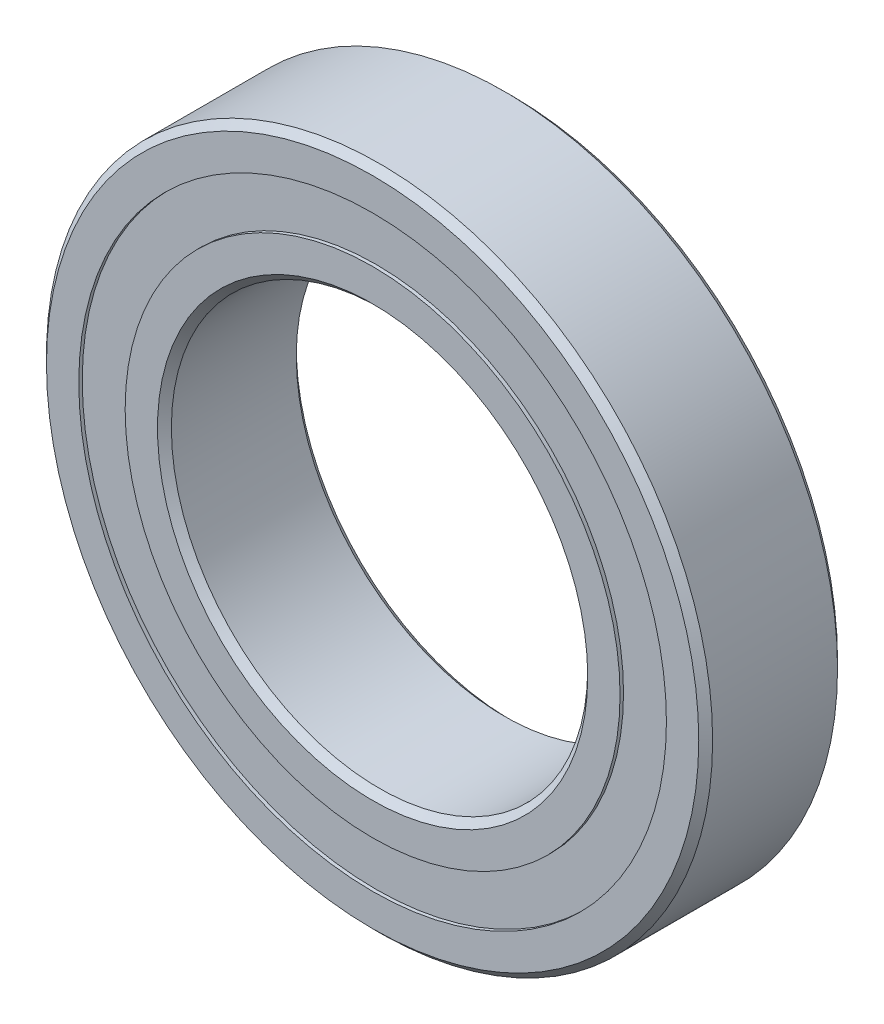
ISO-10303-21;
HEADER;
FILE_DESCRIPTION(('STEP AP214'),'2;1');
FILE_NAME('part.step','',(''),(''),'','','');
FILE_SCHEMA(('AUTOMOTIVE_DESIGN { 1 0 10303 214 1 1 1 1 }'));
ENDSEC;
DATA;
#1=APPLICATION_CONTEXT('core data for automotive mechanical design processes');
#2=APPLICATION_PROTOCOL_DEFINITION('international standard','automotive_design',2000,#1);
#3=PRODUCT_CONTEXT('',#1,'mechanical');
#4=PRODUCT('Part','Part','',(#3));
#5=PRODUCT_RELATED_PRODUCT_CATEGORY('part','',(#4));
#6=PRODUCT_DEFINITION_FORMATION('','',#4);
#7=PRODUCT_DEFINITION_CONTEXT('part definition',#1,'design');
#8=PRODUCT_DEFINITION('design','',#6,#7);
#9=PRODUCT_DEFINITION_SHAPE('','',#8);
#10=(LENGTH_UNIT() NAMED_UNIT(*) SI_UNIT(.MILLI.,.METRE.));
#11=(NAMED_UNIT(*) PLANE_ANGLE_UNIT() SI_UNIT($,.RADIAN.));
#12=(NAMED_UNIT(*) SI_UNIT($,.STERADIAN.) SOLID_ANGLE_UNIT());
#13=UNCERTAINTY_MEASURE_WITH_UNIT(LENGTH_MEASURE(1.E-05),#10,'distance_accuracy_value','');
#14=(GEOMETRIC_REPRESENTATION_CONTEXT(3) GLOBAL_UNCERTAINTY_ASSIGNED_CONTEXT((#13)) GLOBAL_UNIT_ASSIGNED_CONTEXT((#10,
#11,#12)) REPRESENTATION_CONTEXT('',''));
#15=CARTESIAN_POINT('',(0.,0.,0.));
#16=DIRECTION('',(0.,0.,1.));
#17=DIRECTION('',(1.,0.,0.));
#18=AXIS2_PLACEMENT_3D('',#15,#16,#17);
#19=CARTESIAN_POINT('',(0.,10.5851648351648,-2.37500000000001));
#20=DIRECTION('',(0.,0.,1.));
#21=DIRECTION('',(1.,0.,0.));
#22=AXIS2_PLACEMENT_3D('',#19,#20,#21);
#23=PLANE('',#22);
#24=CARTESIAN_POINT('',(0.,0.,-2.37500000000001));
#25=DIRECTION('',(0.,0.,1.));
#26=DIRECTION('',(1.,0.,0.));
#27=AXIS2_PLACEMENT_3D('',#24,#25,#26);
#28=CIRCLE('',#27,10.5851648351648);
#29=CARTESIAN_POINT('',(10.5851648351648,0.,-2.37500000000001));
#30=VERTEX_POINT('',#29);
#31=EDGE_CURVE('E57',#30,#30,#28,.T.);
#32=ORIENTED_EDGE('',*,*,#31,.F.);
#33=EDGE_LOOP('',(#32));
#34=FACE_BOUND('',#33,.T.);
#35=CARTESIAN_POINT('',(0.,0.,-2.37500000000001));
#36=DIRECTION('',(0.,0.,1.));
#37=DIRECTION('',(1.,0.,0.));
#38=AXIS2_PLACEMENT_3D('',#35,#36,#37);
#39=CIRCLE('',#38,8.91483516483517);
#40=CARTESIAN_POINT('',(8.91483516483517,0.,-2.37500000000001));
#41=VERTEX_POINT('',#40);
#42=EDGE_CURVE('E11',#41,#41,#39,.T.);
#43=ORIENTED_EDGE('',*,*,#42,.T.);
#44=EDGE_LOOP('',(#43));
#45=FACE_BOUND('',#44,.T.);
#46=ADVANCED_FACE('F43',(#34,#45),#23,.F.);
#47=CARTESIAN_POINT('',(0.,0.,2.5));
#48=DIRECTION('',(0.,0.,1.));
#49=DIRECTION('',(1.,0.,0.));
#50=AXIS2_PLACEMENT_3D('',#47,#48,#49);
#51=CYLINDRICAL_SURFACE('',#50,8.91483516483517);
#52=ORIENTED_EDGE('',*,*,#42,.F.);
#53=EDGE_LOOP('',(#52));
#54=FACE_BOUND('',#53,.T.);
#55=CARTESIAN_POINT('',(0.,0.,-1.38998856223009));
#56=DIRECTION('',(0.,0.,1.));
#57=DIRECTION('',(1.,0.,0.));
#58=AXIS2_PLACEMENT_3D('',#55,#56,#57);
#59=CIRCLE('',#58,8.91483516483517);
#60=CARTESIAN_POINT('',(8.91483516483517,0.,-1.38998856223009));
#61=VERTEX_POINT('',#60);
#62=EDGE_CURVE('E49',#61,#61,#59,.T.);
#63=ORIENTED_EDGE('',*,*,#62,.T.);
#64=EDGE_LOOP('',(#63));
#65=FACE_BOUND('',#64,.T.);
#66=ADVANCED_FACE('F66',(#54,#65),#51,.F.);
#67=CARTESIAN_POINT('',(0.,10.5851648351648,-1.38998856223009));
#68=DIRECTION('',(0.,0.,-1.));
#69=DIRECTION('',(-1.,0.,0.));
#70=AXIS2_PLACEMENT_3D('',#67,#68,#69);
#71=PLANE('',#70);
#72=ORIENTED_EDGE('',*,*,#62,.F.);
#73=EDGE_LOOP('',(#72));
#74=FACE_BOUND('',#73,.T.);
#75=CARTESIAN_POINT('',(0.,0.,-1.38998856223009));
#76=DIRECTION('',(0.,0.,1.));
#77=DIRECTION('',(1.,0.,0.));
#78=AXIS2_PLACEMENT_3D('',#75,#76,#77);
#79=CIRCLE('',#78,10.5851648351648);
#80=CARTESIAN_POINT('',(10.5851648351648,0.,-1.38998856223009));
#81=VERTEX_POINT('',#80);
#82=EDGE_CURVE('E53',#81,#81,#79,.T.);
#83=ORIENTED_EDGE('',*,*,#82,.T.);
#84=EDGE_LOOP('',(#83));
#85=FACE_BOUND('',#84,.T.);
#86=ADVANCED_FACE('F70',(#74,#85),#71,.F.);
#87=CARTESIAN_POINT('',(0.,0.,2.5));
#88=DIRECTION('',(0.,0.,1.));
#89=DIRECTION('',(1.,0.,0.));
#90=AXIS2_PLACEMENT_3D('',#87,#88,#89);
#91=CYLINDRICAL_SURFACE('',#90,10.5851648351648);
#92=ORIENTED_EDGE('',*,*,#82,.F.);
#93=EDGE_LOOP('',(#92));
#94=FACE_BOUND('',#93,.T.);
#95=ORIENTED_EDGE('',*,*,#31,.T.);
#96=EDGE_LOOP('',(#95));
#97=FACE_BOUND('',#96,.T.);
#98=ADVANCED_FACE('F63',(#94,#97),#91,.T.);
#99=CLOSED_SHELL('',(#46,#66,#86,#98));
#100=MANIFOLD_SOLID_BREP('B2',#99);
#101=CARTESIAN_POINT('',(0.,10.5851648351648,2.375));
#102=DIRECTION('',(0.,0.,-1.));
#103=DIRECTION('',(-1.,0.,0.));
#104=AXIS2_PLACEMENT_3D('',#101,#102,#103);
#105=PLANE('',#104);
#106=CARTESIAN_POINT('',(0.,0.,2.375));
#107=DIRECTION('',(0.,0.,1.));
#108=DIRECTION('',(1.,0.,0.));
#109=AXIS2_PLACEMENT_3D('',#106,#107,#108);
#110=CIRCLE('',#109,8.91483516483517);
#111=CARTESIAN_POINT('',(8.91483516483517,0.,2.375));
#112=VERTEX_POINT('',#111);
#113=EDGE_CURVE('E42',#112,#112,#110,.T.);
#114=ORIENTED_EDGE('',*,*,#113,.F.);
#115=EDGE_LOOP('',(#114));
#116=FACE_BOUND('',#115,.T.);
#117=CARTESIAN_POINT('',(0.,0.,2.375));
#118=DIRECTION('',(0.,0.,1.));
#119=DIRECTION('',(1.,0.,0.));
#120=AXIS2_PLACEMENT_3D('',#117,#118,#119);
#121=CIRCLE('',#120,10.5851648351648);
#122=CARTESIAN_POINT('',(10.5851648351648,0.,2.375));
#123=VERTEX_POINT('',#122);
#124=EDGE_CURVE('E124',#123,#123,#121,.T.);
#125=ORIENTED_EDGE('',*,*,#124,.T.);
#126=EDGE_LOOP('',(#125));
#127=FACE_BOUND('',#126,.T.);
#128=ADVANCED_FACE('F110',(#116,#127),#105,.F.);
#129=CARTESIAN_POINT('',(0.,0.,2.5));
#130=DIRECTION('',(0.,0.,1.));
#131=DIRECTION('',(1.,0.,0.));
#132=AXIS2_PLACEMENT_3D('',#129,#130,#131);
#133=CYLINDRICAL_SURFACE('',#132,8.91483516483517);
#134=CARTESIAN_POINT('',(0.,0.,1.38998856223009));
#135=DIRECTION('',(0.,0.,1.));
#136=DIRECTION('',(1.,0.,0.));
#137=AXIS2_PLACEMENT_3D('',#134,#135,#136);
#138=CIRCLE('',#137,8.91483516483517);
#139=CARTESIAN_POINT('',(8.91483516483517,0.,1.38998856223009));
#140=VERTEX_POINT('',#139);
#141=EDGE_CURVE('E116',#140,#140,#138,.T.);
#142=ORIENTED_EDGE('',*,*,#141,.F.);
#143=EDGE_LOOP('',(#142));
#144=FACE_BOUND('',#143,.T.);
#145=ORIENTED_EDGE('',*,*,#113,.T.);
#146=EDGE_LOOP('',(#145));
#147=FACE_BOUND('',#146,.T.);
#148=ADVANCED_FACE('F139',(#144,#147),#133,.F.);
#149=CARTESIAN_POINT('',(0.,10.5851648351648,1.38998856223009));
#150=DIRECTION('',(0.,0.,1.));
#151=DIRECTION('',(1.,0.,0.));
#152=AXIS2_PLACEMENT_3D('',#149,#150,#151);
#153=PLANE('',#152);
#154=CARTESIAN_POINT('',(0.,0.,1.38998856223009));
#155=DIRECTION('',(0.,0.,1.));
#156=DIRECTION('',(1.,0.,0.));
#157=AXIS2_PLACEMENT_3D('',#154,#155,#156);
#158=CIRCLE('',#157,10.5851648351648);
#159=CARTESIAN_POINT('',(10.5851648351648,0.,1.38998856223009));
#160=VERTEX_POINT('',#159);
#161=EDGE_CURVE('E120',#160,#160,#158,.T.);
#162=ORIENTED_EDGE('',*,*,#161,.F.);
#163=EDGE_LOOP('',(#162));
#164=FACE_BOUND('',#163,.T.);
#165=ORIENTED_EDGE('',*,*,#141,.T.);
#166=EDGE_LOOP('',(#165));
#167=FACE_BOUND('',#166,.T.);
#168=ADVANCED_FACE('F134',(#164,#167),#153,.F.);
#169=CARTESIAN_POINT('',(0.,0.,2.5));
#170=DIRECTION('',(0.,0.,1.));
#171=DIRECTION('',(1.,0.,0.));
#172=AXIS2_PLACEMENT_3D('',#169,#170,#171);
#173=CYLINDRICAL_SURFACE('',#172,10.5851648351648);
#174=ORIENTED_EDGE('',*,*,#124,.F.);
#175=EDGE_LOOP('',(#174));
#176=FACE_BOUND('',#175,.T.);
#177=ORIENTED_EDGE('',*,*,#161,.T.);
#178=EDGE_LOOP('',(#177));
#179=FACE_BOUND('',#178,.T.);
#180=ADVANCED_FACE('F131',(#176,#179),#173,.T.);
#181=CLOSED_SHELL('',(#128,#148,#168,#180));
#182=MANIFOLD_SOLID_BREP('B6',#181);
#183=CARTESIAN_POINT('',(-4.87499999999989,8.44374768689834,0.));
#184=DIRECTION('',(0.,0.,1.));
#185=DIRECTION('',(-0.499999999999989,0.866025403784445,0.));
#186=AXIS2_PLACEMENT_3D('',#183,#184,#185);
#187=SPHERICAL_SURFACE('',#186,1.38998856223009);
#188=CARTESIAN_POINT('',(-4.87499999999989,8.44374768689834,1.38998856223009));
#189=VERTEX_POINT('',#188);
#190=VERTEX_LOOP('',#189);
#191=FACE_BOUND('',#190,.T.);
#192=ADVANCED_FACE('F177',(#191),#187,.T.);
#193=CLOSED_SHELL('',(#192));
#194=MANIFOLD_SOLID_BREP('B37',#193);
#195=CARTESIAN_POINT('',(-8.44374768689822,4.8750000000001,0.));
#196=DIRECTION('',(0.,0.,1.));
#197=DIRECTION('',(-0.866025403784433,0.50000000000001,0.));
#198=AXIS2_PLACEMENT_3D('',#195,#196,#197);
#199=SPHERICAL_SURFACE('',#198,1.38998856223009);
#200=CARTESIAN_POINT('',(-8.44374768689822,4.8750000000001,1.38998856223009));
#201=VERTEX_POINT('',#200);
#202=VERTEX_LOOP('',#201);
#203=FACE_BOUND('',#202,.T.);
#204=ADVANCED_FACE('F197',(#203),#199,.T.);
#205=CLOSED_SHELL('',(#204));
#206=MANIFOLD_SOLID_BREP('B106',#205);
#207=CARTESIAN_POINT('',(-9.75,1.02125829161162E-13,0.));
#208=DIRECTION('',(0.,0.,1.));
#209=DIRECTION('',(-1.,0.,0.));
#210=AXIS2_PLACEMENT_3D('',#207,#208,#209);
#211=SPHERICAL_SURFACE('',#210,1.38998856223009);
#212=CARTESIAN_POINT('',(-9.75,1.02125829161162E-13,1.38998856223009));
#213=VERTEX_POINT('',#212);
#214=VERTEX_LOOP('',#213);
#215=FACE_BOUND('',#214,.T.);
#216=ADVANCED_FACE('F217',(#215),#211,.T.);
#217=CLOSED_SHELL('',(#216));
#218=MANIFOLD_SOLID_BREP('B173',#217);
#219=CARTESIAN_POINT('',(-8.44374768689832,-4.87499999999992,0.));
#220=DIRECTION('',(0.,0.,1.));
#221=DIRECTION('',(-0.866025403784443,-0.499999999999992,0.));
#222=AXIS2_PLACEMENT_3D('',#219,#220,#221);
#223=SPHERICAL_SURFACE('',#222,1.38998856223009);
#224=CARTESIAN_POINT('',(-8.44374768689832,-4.87499999999992,1.38998856223009));
#225=VERTEX_POINT('',#224);
#226=VERTEX_LOOP('',#225);
#227=FACE_BOUND('',#226,.T.);
#228=ADVANCED_FACE('F237',(#227),#223,.T.);
#229=CLOSED_SHELL('',(#228));
#230=MANIFOLD_SOLID_BREP('B193',#229);
#231=CARTESIAN_POINT('',(-4.87500000000007,-8.44374768689824,0.));
#232=DIRECTION('',(0.,0.,1.));
#233=DIRECTION('',(-0.500000000000007,-0.866025403784435,0.));
#234=AXIS2_PLACEMENT_3D('',#231,#232,#233);
#235=SPHERICAL_SURFACE('',#234,1.38998856223009);
#236=CARTESIAN_POINT('',(-4.87500000000007,-8.44374768689824,1.38998856223009));
#237=VERTEX_POINT('',#236);
#238=VERTEX_LOOP('',#237);
#239=FACE_BOUND('',#238,.T.);
#240=ADVANCED_FACE('F257',(#239),#235,.T.);
#241=CLOSED_SHELL('',(#240));
#242=MANIFOLD_SOLID_BREP('B213',#241);
#243=CARTESIAN_POINT('',(0.,-9.75,0.));
#244=DIRECTION('',(0.,0.,1.));
#245=DIRECTION('',(0.,-1.,0.));
#246=AXIS2_PLACEMENT_3D('',#243,#244,#245);
#247=SPHERICAL_SURFACE('',#246,1.38998856223009);
#248=CARTESIAN_POINT('',(0.,-9.75,1.38998856223009));
#249=VERTEX_POINT('',#248);
#250=VERTEX_LOOP('',#249);
#251=FACE_BOUND('',#250,.T.);
#252=ADVANCED_FACE('F277',(#251),#247,.T.);
#253=CLOSED_SHELL('',(#252));
#254=MANIFOLD_SOLID_BREP('B233',#253);
#255=CARTESIAN_POINT('',(4.87499999999995,-8.44374768689831,0.));
#256=DIRECTION('',(0.,0.,1.));
#257=DIRECTION('',(0.499999999999995,-0.866025403784442,0.));
#258=AXIS2_PLACEMENT_3D('',#255,#256,#257);
#259=SPHERICAL_SURFACE('',#258,1.38998856223009);
#260=CARTESIAN_POINT('',(4.87499999999995,-8.44374768689831,1.38998856223009));
#261=VERTEX_POINT('',#260);
#262=VERTEX_LOOP('',#261);
#263=FACE_BOUND('',#262,.T.);
#264=ADVANCED_FACE('F297',(#263),#259,.T.);
#265=CLOSED_SHELL('',(#264));
#266=MANIFOLD_SOLID_BREP('B253',#265);
#267=CARTESIAN_POINT('',(8.44374768689826,-4.87500000000004,0.));
#268=DIRECTION('',(0.,0.,1.));
#269=DIRECTION('',(0.866025403784436,-0.500000000000004,0.));
#270=AXIS2_PLACEMENT_3D('',#267,#268,#269);
#271=SPHERICAL_SURFACE('',#270,1.38998856223009);
#272=CARTESIAN_POINT('',(8.44374768689826,-4.87500000000004,1.38998856223009));
#273=VERTEX_POINT('',#272);
#274=VERTEX_LOOP('',#273);
#275=FACE_BOUND('',#274,.T.);
#276=ADVANCED_FACE('F317',(#275),#271,.T.);
#277=CLOSED_SHELL('',(#276));
#278=MANIFOLD_SOLID_BREP('B273',#277);
#279=CARTESIAN_POINT('',(9.75,0.,0.));
#280=DIRECTION('',(0.,0.,1.));
#281=DIRECTION('',(1.,0.,0.));
#282=AXIS2_PLACEMENT_3D('',#279,#280,#281);
#283=SPHERICAL_SURFACE('',#282,1.38998856223009);
#284=CARTESIAN_POINT('',(9.75,0.,1.38998856223009));
#285=VERTEX_POINT('',#284);
#286=VERTEX_LOOP('',#285);
#287=FACE_BOUND('',#286,.T.);
#288=ADVANCED_FACE('F337',(#287),#283,.T.);
#289=CLOSED_SHELL('',(#288));
#290=MANIFOLD_SOLID_BREP('B293',#289);
#291=CARTESIAN_POINT('',(8.44374768689829,4.87499999999998,0.));
#292=DIRECTION('',(0.,0.,1.));
#293=DIRECTION('',(0.86602540378444,0.499999999999998,0.));
#294=AXIS2_PLACEMENT_3D('',#291,#292,#293);
#295=SPHERICAL_SURFACE('',#294,1.38998856223009);
#296=CARTESIAN_POINT('',(8.44374768689829,4.87499999999998,1.38998856223009));
#297=VERTEX_POINT('',#296);
#298=VERTEX_LOOP('',#297);
#299=FACE_BOUND('',#298,.T.);
#300=ADVANCED_FACE('F357',(#299),#295,.T.);
#301=CLOSED_SHELL('',(#300));
#302=MANIFOLD_SOLID_BREP('B313',#301);
#303=CARTESIAN_POINT('',(4.87500000000001,8.44374768689827,0.));
#304=DIRECTION('',(0.,0.,1.));
#305=DIRECTION('',(0.500000000000001,0.866025403784438,0.));
#306=AXIS2_PLACEMENT_3D('',#303,#304,#305);
#307=SPHERICAL_SURFACE('',#306,1.38998856223009);
#308=CARTESIAN_POINT('',(4.87500000000001,8.44374768689827,1.38998856223009));
#309=VERTEX_POINT('',#308);
#310=VERTEX_LOOP('',#309);
#311=FACE_BOUND('',#310,.T.);
#312=ADVANCED_FACE('F377',(#311),#307,.T.);
#313=CLOSED_SHELL('',(#312));
#314=MANIFOLD_SOLID_BREP('B333',#313);
#315=CARTESIAN_POINT('',(0.,9.75,0.));
#316=DIRECTION('',(0.,0.,1.));
#317=DIRECTION('',(0.,1.,0.));
#318=AXIS2_PLACEMENT_3D('',#315,#316,#317);
#319=SPHERICAL_SURFACE('',#318,1.38998856223009);
#320=CARTESIAN_POINT('',(0.,9.75,1.38998856223009));
#321=VERTEX_POINT('',#320);
#322=VERTEX_LOOP('',#321);
#323=FACE_BOUND('',#322,.T.);
#324=ADVANCED_FACE('F399',(#323),#319,.T.);
#325=CLOSED_SHELL('',(#324));
#326=MANIFOLD_SOLID_BREP('B353',#325);
#327=CARTESIAN_POINT('',(0.,8.91483516483517,2.50000000000001));
#328=DIRECTION('',(0.,0.,-1.));
#329=DIRECTION('',(-1.,0.,0.));
#330=AXIS2_PLACEMENT_3D('',#327,#328,#329);
#331=PLANE('',#330);
#332=CARTESIAN_POINT('',(0.,0.,2.5));
#333=DIRECTION('',(0.,0.,1.));
#334=DIRECTION('',(1.,0.,0.));
#335=AXIS2_PLACEMENT_3D('',#332,#333,#334);
#336=CIRCLE('',#335,7.75000000000001);
#337=CARTESIAN_POINT('',(7.75000000000001,0.,2.5));
#338=VERTEX_POINT('',#337);
#339=EDGE_CURVE('E446',#338,#338,#336,.T.);
#340=ORIENTED_EDGE('',*,*,#339,.F.);
#341=EDGE_LOOP('',(#340));
#342=FACE_BOUND('',#341,.T.);
#343=CARTESIAN_POINT('',(0.,0.,2.50000000000001));
#344=DIRECTION('',(0.,0.,1.));
#345=DIRECTION('',(1.,0.,0.));
#346=AXIS2_PLACEMENT_3D('',#343,#344,#345);
#347=CIRCLE('',#346,8.91483516483517);
#348=CARTESIAN_POINT('',(8.91483516483517,0.,2.50000000000001));
#349=VERTEX_POINT('',#348);
#350=EDGE_CURVE('E398',#349,#349,#347,.T.);
#351=ORIENTED_EDGE('',*,*,#350,.T.);
#352=EDGE_LOOP('',(#351));
#353=FACE_BOUND('',#352,.T.);
#354=ADVANCED_FACE('F418',(#342,#353),#331,.F.);
#355=CARTESIAN_POINT('',(0.,0.,2.5));
#356=DIRECTION('',(0.,0.,1.));
#357=DIRECTION('',(1.,0.,0.));
#358=AXIS2_PLACEMENT_3D('',#355,#356,#357);
#359=CYLINDRICAL_SURFACE('',#358,8.91483516483517);
#360=ORIENTED_EDGE('',*,*,#350,.F.);
#361=EDGE_LOOP('',(#360));
#362=FACE_BOUND('',#361,.T.);
#363=CARTESIAN_POINT('',(0.,0.,1.11111111111111));
#364=DIRECTION('',(0.,0.,1.));
#365=DIRECTION('',(1.,0.,0.));
#366=AXIS2_PLACEMENT_3D('',#363,#364,#365);
#367=CIRCLE('',#366,8.91483516483517);
#368=CARTESIAN_POINT('',(8.91483516483517,0.,1.11111111111111));
#369=VERTEX_POINT('',#368);
#370=EDGE_CURVE('E424',#369,#369,#367,.T.);
#371=ORIENTED_EDGE('',*,*,#370,.T.);
#372=EDGE_LOOP('',(#371));
#373=FACE_BOUND('',#372,.T.);
#374=ADVANCED_FACE('F453',(#362,#373),#359,.T.);
#375=CARTESIAN_POINT('',(0.,0.,0.));
#376=DIRECTION('',(0.,0.,1.));
#377=DIRECTION('',(1.,0.,0.));
#378=AXIS2_PLACEMENT_3D('',#375,#376,#377);
#379=TOROIDAL_SURFACE('',#378,9.75,1.38998856223008);
#380=ORIENTED_EDGE('',*,*,#370,.F.);
#381=EDGE_LOOP('',(#380));
#382=FACE_BOUND('',#381,.T.);
#383=CARTESIAN_POINT('',(0.,0.,-1.11111111111111));
#384=DIRECTION('',(0.,0.,1.));
#385=DIRECTION('',(1.,0.,0.));
#386=AXIS2_PLACEMENT_3D('',#383,#384,#385);
#387=CIRCLE('',#386,8.91483516483517);
#388=CARTESIAN_POINT('',(8.91483516483517,0.,-1.11111111111111));
#389=VERTEX_POINT('',#388);
#390=EDGE_CURVE('E428',#389,#389,#387,.T.);
#391=ORIENTED_EDGE('',*,*,#390,.T.);
#392=EDGE_LOOP('',(#391));
#393=FACE_BOUND('',#392,.T.);
#394=ADVANCED_FACE('F457',(#382,#393),#379,.F.);
#395=CARTESIAN_POINT('',(0.,0.,2.5));
#396=DIRECTION('',(0.,0.,1.));
#397=DIRECTION('',(1.,0.,0.));
#398=AXIS2_PLACEMENT_3D('',#395,#396,#397);
#399=CYLINDRICAL_SURFACE('',#398,8.91483516483517);
#400=ORIENTED_EDGE('',*,*,#390,.F.);
#401=EDGE_LOOP('',(#400));
#402=FACE_BOUND('',#401,.T.);
#403=CARTESIAN_POINT('',(0.,0.,-2.50000000000001));
#404=DIRECTION('',(0.,0.,1.));
#405=DIRECTION('',(1.,0.,0.));
#406=AXIS2_PLACEMENT_3D('',#403,#404,#405);
#407=CIRCLE('',#406,8.91483516483517);
#408=CARTESIAN_POINT('',(8.91483516483517,0.,-2.50000000000001));
#409=VERTEX_POINT('',#408);
#410=EDGE_CURVE('E432',#409,#409,#407,.T.);
#411=ORIENTED_EDGE('',*,*,#410,.T.);
#412=EDGE_LOOP('',(#411));
#413=FACE_BOUND('',#412,.T.);
#414=ADVANCED_FACE('F462',(#402,#413),#399,.T.);
#415=CARTESIAN_POINT('',(0.,7.75,-2.50000000000001));
#416=DIRECTION('',(0.,0.,1.));
#417=DIRECTION('',(1.,0.,0.));
#418=AXIS2_PLACEMENT_3D('',#415,#416,#417);
#419=PLANE('',#418);
#420=ORIENTED_EDGE('',*,*,#410,.F.);
#421=EDGE_LOOP('',(#420));
#422=FACE_BOUND('',#421,.T.);
#423=CARTESIAN_POINT('',(0.,0.,-2.50000000000001));
#424=DIRECTION('',(0.,0.,1.));
#425=DIRECTION('',(1.,0.,0.));
#426=AXIS2_PLACEMENT_3D('',#423,#424,#425);
#427=CIRCLE('',#426,7.75);
#428=CARTESIAN_POINT('',(7.75,0.,-2.50000000000001));
#429=VERTEX_POINT('',#428);
#430=EDGE_CURVE('E437',#429,#429,#427,.T.);
#431=ORIENTED_EDGE('',*,*,#430,.T.);
#432=EDGE_LOOP('',(#431));
#433=FACE_BOUND('',#432,.T.);
#434=ADVANCED_FACE('F468',(#422,#433),#419,.F.);
#435=CARTESIAN_POINT('',(0.,0.,-2.25000000000001));
#436=DIRECTION('',(0.,0.,-1.));
#437=DIRECTION('',(-1.,0.,0.));
#438=AXIS2_PLACEMENT_3D('',#435,#436,#437);
#439=CONICAL_SURFACE('',#438,7.5,0.785398163397448);
#440=ORIENTED_EDGE('',*,*,#430,.F.);
#441=EDGE_LOOP('',(#440));
#442=FACE_BOUND('',#441,.T.);
#443=CARTESIAN_POINT('',(0.,0.,-2.25000000000001));
#444=DIRECTION('',(0.,0.,1.));
#445=DIRECTION('',(1.,0.,0.));
#446=AXIS2_PLACEMENT_3D('',#443,#444,#445);
#447=CIRCLE('',#446,7.5);
#448=CARTESIAN_POINT('',(7.5,0.,-2.25000000000001));
#449=VERTEX_POINT('',#448);
#450=EDGE_CURVE('E440',#449,#449,#447,.T.);
#451=ORIENTED_EDGE('',*,*,#450,.T.);
#452=EDGE_LOOP('',(#451));
#453=FACE_BOUND('',#452,.T.);
#454=ADVANCED_FACE('F472',(#442,#453),#439,.F.);
#455=CARTESIAN_POINT('',(0.,0.,2.5));
#456=DIRECTION('',(0.,0.,1.));
#457=DIRECTION('',(1.,0.,0.));
#458=AXIS2_PLACEMENT_3D('',#455,#456,#457);
#459=CYLINDRICAL_SURFACE('',#458,7.5);
#460=ORIENTED_EDGE('',*,*,#450,.F.);
#461=EDGE_LOOP('',(#460));
#462=FACE_BOUND('',#461,.T.);
#463=CARTESIAN_POINT('',(0.,0.,2.25000000000001));
#464=DIRECTION('',(0.,0.,1.));
#465=DIRECTION('',(1.,0.,0.));
#466=AXIS2_PLACEMENT_3D('',#463,#464,#465);
#467=CIRCLE('',#466,7.5);
#468=CARTESIAN_POINT('',(7.5,0.,2.25000000000001));
#469=VERTEX_POINT('',#468);
#470=EDGE_CURVE('E443',#469,#469,#467,.T.);
#471=ORIENTED_EDGE('',*,*,#470,.T.);
#472=EDGE_LOOP('',(#471));
#473=FACE_BOUND('',#472,.T.);
#474=ADVANCED_FACE('F476',(#462,#473),#459,.F.);
#475=CARTESIAN_POINT('',(0.,0.,2.5));
#476=DIRECTION('',(0.,0.,1.));
#477=DIRECTION('',(1.,0.,0.));
#478=AXIS2_PLACEMENT_3D('',#475,#476,#477);
#479=CONICAL_SURFACE('',#478,7.75000000000001,0.785398163397453);
#480=ORIENTED_EDGE('',*,*,#470,.F.);
#481=EDGE_LOOP('',(#480));
#482=FACE_BOUND('',#481,.T.);
#483=ORIENTED_EDGE('',*,*,#339,.T.);
#484=EDGE_LOOP('',(#483));
#485=FACE_BOUND('',#484,.T.);
#486=ADVANCED_FACE('F450',(#482,#485),#479,.F.);
#487=CLOSED_SHELL('',(#354,#374,#394,#414,#434,#454,#474,#486));
#488=MANIFOLD_SOLID_BREP('B373',#487);
#489=CARTESIAN_POINT('',(0.,0.,2.25));
#490=DIRECTION('',(0.,0.,-1.));
#491=DIRECTION('',(-1.,0.,0.));
#492=AXIS2_PLACEMENT_3D('',#489,#490,#491);
#493=CONICAL_SURFACE('',#492,12.,0.785398163397448);
#494=CARTESIAN_POINT('',(0.,0.,2.5));
#495=DIRECTION('',(0.,0.,1.));
#496=DIRECTION('',(1.,0.,0.));
#497=AXIS2_PLACEMENT_3D('',#494,#495,#496);
#498=CIRCLE('',#497,11.75);
#499=CARTESIAN_POINT('',(11.75,0.,2.5));
#500=VERTEX_POINT('',#499);
#501=EDGE_CURVE('E567',#500,#500,#498,.T.);
#502=ORIENTED_EDGE('',*,*,#501,.F.);
#503=EDGE_LOOP('',(#502));
#504=FACE_BOUND('',#503,.T.);
#505=CARTESIAN_POINT('',(0.,0.,2.25));
#506=DIRECTION('',(0.,0.,1.));
#507=DIRECTION('',(1.,0.,0.));
#508=AXIS2_PLACEMENT_3D('',#505,#506,#507);
#509=CIRCLE('',#508,12.);
#510=CARTESIAN_POINT('',(12.,0.,2.25));
#511=VERTEX_POINT('',#510);
#512=EDGE_CURVE('E417',#511,#511,#509,.T.);
#513=ORIENTED_EDGE('',*,*,#512,.T.);
#514=EDGE_LOOP('',(#513));
#515=FACE_BOUND('',#514,.T.);
#516=ADVANCED_FACE('F539',(#504,#515),#493,.T.);
#517=CARTESIAN_POINT('',(0.,0.,2.5));
#518=DIRECTION('',(0.,0.,1.));
#519=DIRECTION('',(1.,0.,0.));
#520=AXIS2_PLACEMENT_3D('',#517,#518,#519);
#521=CYLINDRICAL_SURFACE('',#520,12.);
#522=ORIENTED_EDGE('',*,*,#512,.F.);
#523=EDGE_LOOP('',(#522));
#524=FACE_BOUND('',#523,.T.);
#525=CARTESIAN_POINT('',(0.,0.,-2.25000000000001));
#526=DIRECTION('',(0.,0.,1.));
#527=DIRECTION('',(1.,0.,0.));
#528=AXIS2_PLACEMENT_3D('',#525,#526,#527);
#529=CIRCLE('',#528,12.);
#530=CARTESIAN_POINT('',(12.,0.,-2.25000000000001));
#531=VERTEX_POINT('',#530);
#532=EDGE_CURVE('E545',#531,#531,#529,.T.);
#533=ORIENTED_EDGE('',*,*,#532,.T.);
#534=EDGE_LOOP('',(#533));
#535=FACE_BOUND('',#534,.T.);
#536=ADVANCED_FACE('F574',(#524,#535),#521,.T.);
#537=CARTESIAN_POINT('',(0.,0.,-2.50000000000001));
#538=DIRECTION('',(0.,0.,1.));
#539=DIRECTION('',(1.,0.,0.));
#540=AXIS2_PLACEMENT_3D('',#537,#538,#539);
#541=CONICAL_SURFACE('',#540,11.75,0.785398163397448);
#542=ORIENTED_EDGE('',*,*,#532,.F.);
#543=EDGE_LOOP('',(#542));
#544=FACE_BOUND('',#543,.T.);
#545=CARTESIAN_POINT('',(0.,0.,-2.50000000000001));
#546=DIRECTION('',(0.,0.,1.));
#547=DIRECTION('',(1.,0.,0.));
#548=AXIS2_PLACEMENT_3D('',#545,#546,#547);
#549=CIRCLE('',#548,11.75);
#550=CARTESIAN_POINT('',(11.75,0.,-2.50000000000001));
#551=VERTEX_POINT('',#550);
#552=EDGE_CURVE('E549',#551,#551,#549,.T.);
#553=ORIENTED_EDGE('',*,*,#552,.T.);
#554=EDGE_LOOP('',(#553));
#555=FACE_BOUND('',#554,.T.);
#556=ADVANCED_FACE('F578',(#544,#555),#541,.T.);
#557=CARTESIAN_POINT('',(0.,11.75,-2.50000000000001));
#558=DIRECTION('',(0.,0.,1.));
#559=DIRECTION('',(1.,0.,0.));
#560=AXIS2_PLACEMENT_3D('',#557,#558,#559);
#561=PLANE('',#560);
#562=ORIENTED_EDGE('',*,*,#552,.F.);
#563=EDGE_LOOP('',(#562));
#564=FACE_BOUND('',#563,.T.);
#565=CARTESIAN_POINT('',(0.,0.,-2.50000000000001));
#566=DIRECTION('',(0.,0.,1.));
#567=DIRECTION('',(1.,0.,0.));
#568=AXIS2_PLACEMENT_3D('',#565,#566,#567);
#569=CIRCLE('',#568,10.5851648351648);
#570=CARTESIAN_POINT('',(10.5851648351648,0.,-2.50000000000001));
#571=VERTEX_POINT('',#570);
#572=EDGE_CURVE('E553',#571,#571,#569,.T.);
#573=ORIENTED_EDGE('',*,*,#572,.T.);
#574=EDGE_LOOP('',(#573));
#575=FACE_BOUND('',#574,.T.);
#576=ADVANCED_FACE('F583',(#564,#575),#561,.F.);
#577=CARTESIAN_POINT('',(0.,0.,2.5));
#578=DIRECTION('',(0.,0.,1.));
#579=DIRECTION('',(1.,0.,0.));
#580=AXIS2_PLACEMENT_3D('',#577,#578,#579);
#581=CYLINDRICAL_SURFACE('',#580,10.5851648351648);
#582=ORIENTED_EDGE('',*,*,#572,.F.);
#583=EDGE_LOOP('',(#582));
#584=FACE_BOUND('',#583,.T.);
#585=CARTESIAN_POINT('',(0.,0.,-1.11111111111111));
#586=DIRECTION('',(0.,0.,1.));
#587=DIRECTION('',(1.,0.,0.));
#588=AXIS2_PLACEMENT_3D('',#585,#586,#587);
#589=CIRCLE('',#588,10.5851648351648);
#590=CARTESIAN_POINT('',(10.5851648351648,0.,-1.11111111111111));
#591=VERTEX_POINT('',#590);
#592=EDGE_CURVE('E558',#591,#591,#589,.T.);
#593=ORIENTED_EDGE('',*,*,#592,.T.);
#594=EDGE_LOOP('',(#593));
#595=FACE_BOUND('',#594,.T.);
#596=ADVANCED_FACE('F589',(#584,#595),#581,.F.);
#597=CARTESIAN_POINT('',(0.,0.,0.));
#598=DIRECTION('',(0.,0.,1.));
#599=DIRECTION('',(1.,0.,0.));
#600=AXIS2_PLACEMENT_3D('',#597,#598,#599);
#601=TOROIDAL_SURFACE('',#600,9.75,1.38998856223009);
#602=ORIENTED_EDGE('',*,*,#592,.F.);
#603=EDGE_LOOP('',(#602));
#604=FACE_BOUND('',#603,.T.);
#605=CARTESIAN_POINT('',(0.,0.,1.11111111111111));
#606=DIRECTION('',(0.,0.,1.));
#607=DIRECTION('',(1.,0.,0.));
#608=AXIS2_PLACEMENT_3D('',#605,#606,#607);
#609=CIRCLE('',#608,10.5851648351648);
#610=CARTESIAN_POINT('',(10.5851648351648,0.,1.11111111111111));
#611=VERTEX_POINT('',#610);
#612=EDGE_CURVE('E561',#611,#611,#609,.T.);
#613=ORIENTED_EDGE('',*,*,#612,.T.);
#614=EDGE_LOOP('',(#613));
#615=FACE_BOUND('',#614,.T.);
#616=ADVANCED_FACE('F593',(#604,#615),#601,.F.);
#617=CARTESIAN_POINT('',(0.,0.,2.5));
#618=DIRECTION('',(0.,0.,1.));
#619=DIRECTION('',(1.,0.,0.));
#620=AXIS2_PLACEMENT_3D('',#617,#618,#619);
#621=CYLINDRICAL_SURFACE('',#620,10.5851648351648);
#622=ORIENTED_EDGE('',*,*,#612,.F.);
#623=EDGE_LOOP('',(#622));
#624=FACE_BOUND('',#623,.T.);
#625=CARTESIAN_POINT('',(0.,0.,2.5));
#626=DIRECTION('',(0.,0.,1.));
#627=DIRECTION('',(1.,0.,0.));
#628=AXIS2_PLACEMENT_3D('',#625,#626,#627);
#629=CIRCLE('',#628,10.5851648351648);
#630=CARTESIAN_POINT('',(10.5851648351648,0.,2.5));
#631=VERTEX_POINT('',#630);
#632=EDGE_CURVE('E564',#631,#631,#629,.T.);
#633=ORIENTED_EDGE('',*,*,#632,.T.);
#634=EDGE_LOOP('',(#633));
#635=FACE_BOUND('',#634,.T.);
#636=ADVANCED_FACE('F597',(#624,#635),#621,.F.);
#637=CARTESIAN_POINT('',(0.,11.75,2.5));
#638=DIRECTION('',(0.,0.,-1.));
#639=DIRECTION('',(-1.,0.,0.));
#640=AXIS2_PLACEMENT_3D('',#637,#638,#639);
#641=PLANE('',#640);
#642=ORIENTED_EDGE('',*,*,#632,.F.);
#643=EDGE_LOOP('',(#642));
#644=FACE_BOUND('',#643,.T.);
#645=ORIENTED_EDGE('',*,*,#501,.T.);
#646=EDGE_LOOP('',(#645));
#647=FACE_BOUND('',#646,.T.);
#648=ADVANCED_FACE('F571',(#644,#647),#641,.F.);
#649=CLOSED_SHELL('',(#516,#536,#556,#576,#596,#616,#636,#648));
#650=MANIFOLD_SOLID_BREP('B393',#649);
#651=ADVANCED_BREP_SHAPE_REPRESENTATION('',(#18,#100,#182,#194,#206,#218,#230,#242,#254,#266,
#278,#290,#302,#314,#326,#488,#650),#14);
#652=SHAPE_DEFINITION_REPRESENTATION(#9,#651);
ENDSEC;
END-ISO-10303-21;
